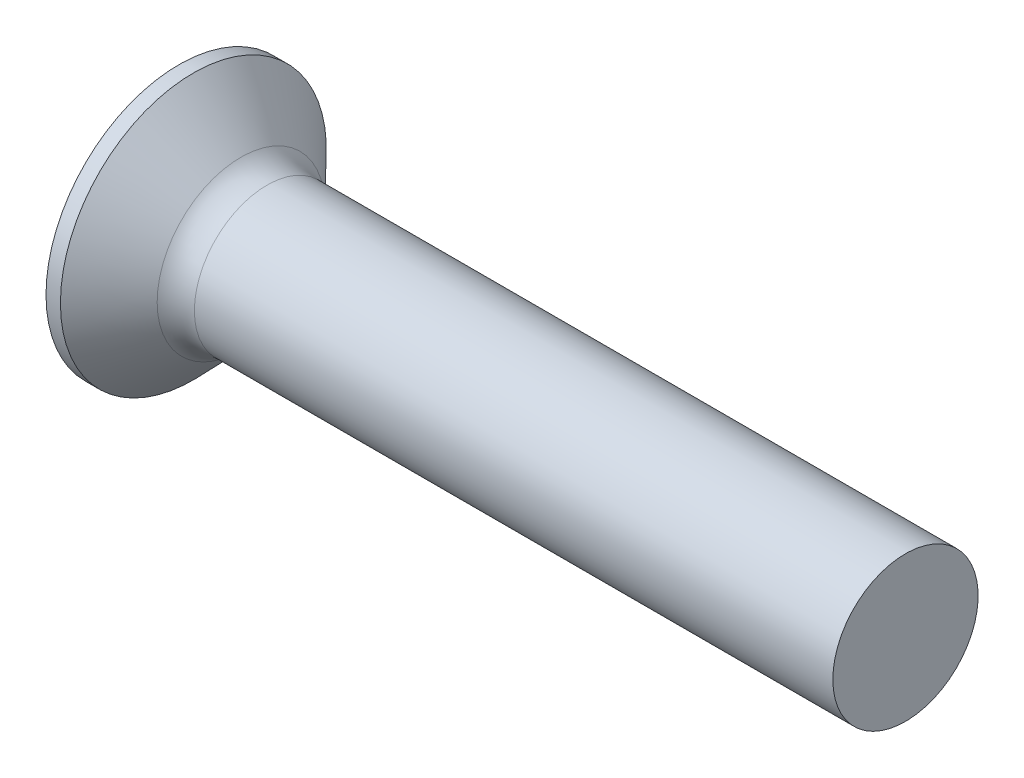
ISO-10303-21;
HEADER;
FILE_DESCRIPTION(('STEP AP214'),'2;1');
FILE_NAME('part.step','',(''),(''),'','','');
FILE_SCHEMA(('AUTOMOTIVE_DESIGN { 1 0 10303 214 1 1 1 1 }'));
ENDSEC;
DATA;
#1=APPLICATION_CONTEXT('core data for automotive mechanical design processes');
#2=APPLICATION_PROTOCOL_DEFINITION('international standard','automotive_design',2000,#1);
#3=PRODUCT_CONTEXT('',#1,'mechanical');
#4=PRODUCT('Part','Part','',(#3));
#5=PRODUCT_RELATED_PRODUCT_CATEGORY('part','',(#4));
#6=PRODUCT_DEFINITION_FORMATION('','',#4);
#7=PRODUCT_DEFINITION_CONTEXT('part definition',#1,'design');
#8=PRODUCT_DEFINITION('design','',#6,#7);
#9=PRODUCT_DEFINITION_SHAPE('','',#8);
#10=(LENGTH_UNIT() NAMED_UNIT(*) SI_UNIT(.MILLI.,.METRE.));
#11=(NAMED_UNIT(*) PLANE_ANGLE_UNIT() SI_UNIT($,.RADIAN.));
#12=(NAMED_UNIT(*) SI_UNIT($,.STERADIAN.) SOLID_ANGLE_UNIT());
#13=UNCERTAINTY_MEASURE_WITH_UNIT(LENGTH_MEASURE(1.E-05),#10,'distance_accuracy_value','');
#14=(GEOMETRIC_REPRESENTATION_CONTEXT(3) GLOBAL_UNCERTAINTY_ASSIGNED_CONTEXT((#13)) GLOBAL_UNIT_ASSIGNED_CONTEXT((#10,
#11,#12)) REPRESENTATION_CONTEXT('',''));
#15=CARTESIAN_POINT('',(0.,0.,0.));
#16=DIRECTION('',(0.,0.,1.));
#17=DIRECTION('',(1.,0.,0.));
#18=AXIS2_PLACEMENT_3D('',#15,#16,#17);
#19=CARTESIAN_POINT('',(5.64,-2.08800020083358,1.08));
#20=DIRECTION('',(0.,0.,-1.));
#21=DIRECTION('',(0.,1.,0.));
#22=AXIS2_PLACEMENT_3D('',#19,#20,#21);
#23=PLANE('',#22);
#24=DIRECTION('',(0.,-1.,0.));
#25=VECTOR('',#24,1.);
#26=CARTESIAN_POINT('',(0.,4.9,1.08));
#27=LINE('',#26,#25);
#28=CARTESIAN_POINT('',(0.,-2.05881047761803,1.08));
#29=VERTEX_POINT('',#28);
#30=CARTESIAN_POINT('',(0.,-4.9,1.08));
#31=VERTEX_POINT('',#30);
#32=EDGE_CURVE('E312',#29,#31,#27,.T.);
#33=ORIENTED_EDGE('',*,*,#32,.F.);
#34=CARTESIAN_POINT('',(-3.508552371452,-2.33231165002222,1.08));
#35=CARTESIAN_POINT('',(-2.8021242785535,-2.27786290347494,1.08));
#36=CARTESIAN_POINT('',(-2.09572000083794,-2.22310096882498,1.08));
#37=CARTESIAN_POINT('',(-0.682963739884883,-2.11273813340588,1.08));
#38=CARTESIAN_POINT('',(0.023388242128016,-2.05713721697088,1.08));
#39=CARTESIAN_POINT('',(1.08285390271521,-1.97294867301993,1.08));
#40=CARTESIAN_POINT('',(1.43599884659094,-1.94475462132179,1.08));
#41=CARTESIAN_POINT('',(2.14226366201043,-1.88806550876942,1.08));
#42=CARTESIAN_POINT('',(2.49538353361693,-1.8595704486972,1.08));
#43=CARTESIAN_POINT('',(3.2015889523463,-1.8022365024152,1.08));
#44=CARTESIAN_POINT('',(3.55467449997447,-1.77339762243347,1.08));
#45=CARTESIAN_POINT('',(4.26081605784269,-1.71532132056914,1.08));
#46=CARTESIAN_POINT('',(4.61387206778542,-1.68608389507013,1.08));
#47=CARTESIAN_POINT('',(5.41612732471709,-1.61911650604659,1.08));
#48=CARTESIAN_POINT('',(5.86531460668916,-1.58124295320442,1.08));
#49=CARTESIAN_POINT('',(6.76360881538388,-1.50456871786306,1.08));
#50=CARTESIAN_POINT('',(7.21271574234448,-1.46576803815681,1.08));
#51=CARTESIAN_POINT('',(8.11080846678724,-1.38699687421515,1.08));
#52=CARTESIAN_POINT('',(8.55979426851681,-1.34702643850978,1.08));
#53=CARTESIAN_POINT('',(9.45763439362018,-1.26556606443146,1.08));
#54=CARTESIAN_POINT('',(9.90648871523721,-1.22407610661242,1.08));
#55=CARTESIAN_POINT('',(10.804086472022,-1.13904091064148,1.08));
#56=CARTESIAN_POINT('',(11.2528298716191,-1.09549529593565,1.08));
#57=CARTESIAN_POINT('',(12.1500162616112,-1.00552937785306,1.08));
#58=CARTESIAN_POINT('',(12.5984592620319,-0.959109175798602,1.08));
#59=CARTESIAN_POINT('',(13.2708059653168,-0.8861578155995,1.08));
#60=CARTESIAN_POINT('',(13.4948891256712,-0.861284749868425,1.08));
#61=CARTESIAN_POINT('',(13.9428873803505,-0.810096676380915,1.08));
#62=CARTESIAN_POINT('',(14.1668024775431,-0.783781693824127,1.08));
#63=CARTESIAN_POINT('',(14.6144284155526,-0.729227223623335,1.08));
#64=CARTESIAN_POINT('',(14.8381392281789,-0.700987502036454,1.08));
#65=CARTESIAN_POINT('',(15.1734409779729,-0.656575769482208,1.08));
#66=CARTESIAN_POINT('',(15.2851674140663,-0.64142936052081,1.08));
#67=CARTESIAN_POINT('',(15.5085023247459,-0.610277030221323,1.08));
#68=CARTESIAN_POINT('',(15.6201107970542,-0.594271092583295,1.08));
#69=CARTESIAN_POINT('',(15.731644359719,-0.577747837441693,1.08));
#70=B_SPLINE_CURVE_WITH_KNOTS('',3,(#34,#35,#36,#37,#38,#39,#40,#41,#42,#43,#44,#45,#46,#47,#48,
#49,#50,#51,#52,#53,#54,#55,#56,#57,#58,#59,#60,#61,#62,#63,#64,#65,#66,#67,#68,#69),
.UNSPECIFIED.,.F.,.F.,(4,2,2,2,2,2,2,2,2,2,2,2,2,2,2,2,2,4),(0.,2.12557045381571,
4.25118064652266,5.31398639952898,6.37678939206669,7.4395731618212,8.50236658170693,
9.85470917308544,11.2070476910761,12.559330183477,13.9116299877686,15.2641784740572,
16.6166793133679,17.2930539423714,17.9694167544874,18.6458619223979,18.984104295463,
19.3223530851586),.UNSPECIFIED.);
#71=CARTESIAN_POINT('',(5.64,-1.60013444747621,1.08));
#72=VERTEX_POINT('',#71);
#73=EDGE_CURVE('E192',#29,#72,#70,.T.);
#74=ORIENTED_EDGE('',*,*,#73,.T.);
#75=DIRECTION('',(0.,-1.,0.));
#76=VECTOR('',#75,1.);
#77=CARTESIAN_POINT('',(5.64,2.08800020083358,1.08));
#78=LINE('',#77,#76);
#79=CARTESIAN_POINT('',(5.64,-2.08800020083358,1.08));
#80=VERTEX_POINT('',#79);
#81=EDGE_CURVE('E336',#72,#80,#78,.T.);
#82=ORIENTED_EDGE('',*,*,#81,.T.);
#83=DIRECTION('',(0.894934391398443,0.446197753347436,0.));
#84=VECTOR('',#83,1.);
#85=CARTESIAN_POINT('',(0.,-4.9,1.08));
#86=LINE('',#85,#84);
#87=EDGE_CURVE('E323',#31,#80,#86,.T.);
#88=ORIENTED_EDGE('',*,*,#87,.F.);
#89=EDGE_LOOP('',(#33,#74,#82,#88));
#90=FACE_BOUND('',#89,.T.);
#91=ADVANCED_FACE('F34',(#90),#23,.T.);
#92=CARTESIAN_POINT('',(5.64,2.08800020083359,1.08));
#93=VERTEX_POINT('',#92);
#94=CARTESIAN_POINT('',(5.64,1.60013444747621,1.08));
#95=VERTEX_POINT('',#94);
#96=EDGE_CURVE('E338',#93,#95,#78,.T.);
#97=ORIENTED_EDGE('',*,*,#96,.T.);
#98=CARTESIAN_POINT('',(-3.508552371452,2.33231165002222,1.08));
#99=CARTESIAN_POINT('',(-2.8021242785535,2.27786290347494,1.08));
#100=CARTESIAN_POINT('',(-2.09572000083793,2.22310096882498,1.08));
#101=CARTESIAN_POINT('',(-0.682963739884882,2.11273813340588,1.08));
#102=CARTESIAN_POINT('',(0.0233882421280164,2.05713721697088,1.08));
#103=CARTESIAN_POINT('',(1.08285390271521,1.97294867301993,1.08));
#104=CARTESIAN_POINT('',(1.43599884659094,1.94475462132179,1.08));
#105=CARTESIAN_POINT('',(2.14226366201043,1.88806550876942,1.08));
#106=CARTESIAN_POINT('',(2.49538353361693,1.8595704486972,1.08));
#107=CARTESIAN_POINT('',(3.2015889523463,1.8022365024152,1.08));
#108=CARTESIAN_POINT('',(3.55467449997447,1.77339762243347,1.08));
#109=CARTESIAN_POINT('',(4.26081605784269,1.71532132056914,1.08));
#110=CARTESIAN_POINT('',(4.61387206778542,1.68608389507013,1.08));
#111=CARTESIAN_POINT('',(5.41612732471709,1.61911650604659,1.08));
#112=CARTESIAN_POINT('',(5.86531460668916,1.58124295320442,1.08));
#113=CARTESIAN_POINT('',(6.76360881538388,1.50456871786306,1.08));
#114=CARTESIAN_POINT('',(7.21271574234448,1.46576803815681,1.08));
#115=CARTESIAN_POINT('',(8.11080846678724,1.38699687421515,1.08));
#116=CARTESIAN_POINT('',(8.55979426851681,1.34702643850978,1.08));
#117=CARTESIAN_POINT('',(9.45763439362018,1.26556606443146,1.08));
#118=CARTESIAN_POINT('',(9.90648871523721,1.22407610661242,1.08));
#119=CARTESIAN_POINT('',(10.804086472022,1.13904091064148,1.08));
#120=CARTESIAN_POINT('',(11.2528298716191,1.09549529593565,1.08));
#121=CARTESIAN_POINT('',(12.1500162616112,1.00552937785306,1.08));
#122=CARTESIAN_POINT('',(12.5984592620319,0.959109175798602,1.08));
#123=CARTESIAN_POINT('',(13.2708059653168,0.8861578155995,1.08));
#124=CARTESIAN_POINT('',(13.4948891256712,0.861284749868425,1.08));
#125=CARTESIAN_POINT('',(13.9428873803505,0.810096676380915,1.08));
#126=CARTESIAN_POINT('',(14.1668024775431,0.783781693824127,1.08));
#127=CARTESIAN_POINT('',(14.6144284155526,0.729227223623334,1.08));
#128=CARTESIAN_POINT('',(14.8381392281789,0.700987502036454,1.08));
#129=CARTESIAN_POINT('',(15.1734409779729,0.656575769482207,1.08));
#130=CARTESIAN_POINT('',(15.2851674140663,0.64142936052081,1.08));
#131=CARTESIAN_POINT('',(15.5085023247459,0.610277030221323,1.08));
#132=CARTESIAN_POINT('',(15.6201107970543,0.594271092583295,1.08));
#133=CARTESIAN_POINT('',(15.731644359719,0.577747837441693,1.08));
#134=B_SPLINE_CURVE_WITH_KNOTS('',3,(#98,#99,#100,#101,#102,#103,#104,#105,#106,#107,#108,#109,
#110,#111,#112,#113,#114,#115,#116,#117,#118,#119,#120,#121,#122,#123,#124,#125,#126,#127,#128,
#129,#130,#131,#132,#133),.UNSPECIFIED.,.F.,.F.,(4,2,2,2,2,2,2,2,2,2,2,2,2,2,2,2,2,4),(0.,
2.12557045381571,4.25118064652265,5.31398639952898,6.37678939206668,7.43957316182119,
8.50236658170693,9.85470917308544,11.2070476910761,12.559330183477,13.9116299877686,
15.2641784740572,16.6166793133679,17.2930539423714,17.9694167544874,18.6458619223979,
18.984104295463,19.3223530851586),.UNSPECIFIED.);
#135=CARTESIAN_POINT('',(0.,2.05881047761803,1.08));
#136=VERTEX_POINT('',#135);
#137=EDGE_CURVE('E185',#95,#136,#134,.F.);
#138=ORIENTED_EDGE('',*,*,#137,.T.);
#139=CARTESIAN_POINT('',(0.,4.9,1.08));
#140=VERTEX_POINT('',#139);
#141=EDGE_CURVE('E314',#140,#136,#27,.T.);
#142=ORIENTED_EDGE('',*,*,#141,.F.);
#143=DIRECTION('',(0.894934391398442,-0.446197753347436,0.));
#144=VECTOR('',#143,1.);
#145=CARTESIAN_POINT('',(0.,4.9,1.08));
#146=LINE('',#145,#144);
#147=EDGE_CURVE('E63',#140,#93,#146,.T.);
#148=ORIENTED_EDGE('',*,*,#147,.T.);
#149=EDGE_LOOP('',(#97,#138,#142,#148));
#150=FACE_BOUND('',#149,.T.);
#151=ADVANCED_FACE('F167',(#150),#23,.T.);
#152=CARTESIAN_POINT('',(5.64,2.08800020083359,-1.08));
#153=DIRECTION('',(0.,0.,1.));
#154=DIRECTION('',(0.,-1.,0.));
#155=AXIS2_PLACEMENT_3D('',#152,#153,#154);
#156=PLANE('',#155);
#157=DIRECTION('',(0.,1.,0.));
#158=VECTOR('',#157,1.);
#159=CARTESIAN_POINT('',(5.64,-2.08800020083359,-1.08));
#160=LINE('',#159,#158);
#161=CARTESIAN_POINT('',(5.64,-2.08800020083359,-1.08));
#162=VERTEX_POINT('',#161);
#163=CARTESIAN_POINT('',(5.64,-1.60013444747621,-1.08));
#164=VERTEX_POINT('',#163);
#165=EDGE_CURVE('E337',#162,#164,#160,.T.);
#166=ORIENTED_EDGE('',*,*,#165,.T.);
#167=CARTESIAN_POINT('',(-3.508552371452,-2.33231165002222,-1.08));
#168=CARTESIAN_POINT('',(-2.8021242785535,-2.27786290347494,-1.08));
#169=CARTESIAN_POINT('',(-2.09572000083793,-2.22310096882498,-1.08));
#170=CARTESIAN_POINT('',(-0.682963739884882,-2.11273813340588,-1.08));
#171=CARTESIAN_POINT('',(0.0233882421280164,-2.05713721697088,-1.08));
#172=CARTESIAN_POINT('',(1.08285390271521,-1.97294867301993,-1.08));
#173=CARTESIAN_POINT('',(1.43599884659094,-1.94475462132179,-1.08));
#174=CARTESIAN_POINT('',(2.14226366201043,-1.88806550876942,-1.08));
#175=CARTESIAN_POINT('',(2.49538353361693,-1.8595704486972,-1.08));
#176=CARTESIAN_POINT('',(3.2015889523463,-1.8022365024152,-1.08));
#177=CARTESIAN_POINT('',(3.55467449997447,-1.77339762243347,-1.08));
#178=CARTESIAN_POINT('',(4.26081605784269,-1.71532132056914,-1.08));
#179=CARTESIAN_POINT('',(4.61387206778542,-1.68608389507013,-1.08));
#180=CARTESIAN_POINT('',(5.41612732471709,-1.61911650604659,-1.08));
#181=CARTESIAN_POINT('',(5.86531460668916,-1.58124295320442,-1.08));
#182=CARTESIAN_POINT('',(6.76360881538388,-1.50456871786306,-1.08));
#183=CARTESIAN_POINT('',(7.21271574234448,-1.46576803815681,-1.08));
#184=CARTESIAN_POINT('',(8.11080846678724,-1.38699687421515,-1.08));
#185=CARTESIAN_POINT('',(8.55979426851681,-1.34702643850978,-1.08));
#186=CARTESIAN_POINT('',(9.45763439362018,-1.26556606443146,-1.08));
#187=CARTESIAN_POINT('',(9.90648871523721,-1.22407610661242,-1.08));
#188=CARTESIAN_POINT('',(10.804086472022,-1.13904091064148,-1.08));
#189=CARTESIAN_POINT('',(11.2528298716191,-1.09549529593565,-1.08));
#190=CARTESIAN_POINT('',(12.1500162616112,-1.00552937785306,-1.08));
#191=CARTESIAN_POINT('',(12.5984592620319,-0.959109175798602,-1.08));
#192=CARTESIAN_POINT('',(13.2708059653168,-0.8861578155995,-1.08));
#193=CARTESIAN_POINT('',(13.4948891256712,-0.861284749868425,-1.08));
#194=CARTESIAN_POINT('',(13.9428873803505,-0.810096676380915,-1.08));
#195=CARTESIAN_POINT('',(14.1668024775431,-0.783781693824127,-1.08));
#196=CARTESIAN_POINT('',(14.6144284155526,-0.729227223623334,-1.08));
#197=CARTESIAN_POINT('',(14.8381392281789,-0.700987502036453,-1.08));
#198=CARTESIAN_POINT('',(15.1734409779729,-0.656575769482206,-1.08));
#199=CARTESIAN_POINT('',(15.2851674140663,-0.641429360520809,-1.08));
#200=CARTESIAN_POINT('',(15.5085023247459,-0.610277030221322,-1.08));
#201=CARTESIAN_POINT('',(15.6201107970543,-0.594271092583294,-1.08));
#202=CARTESIAN_POINT('',(15.731644359719,-0.577747837441693,-1.08));
#203=B_SPLINE_CURVE_WITH_KNOTS('',3,(#167,#168,#169,#170,#171,#172,#173,#174,#175,#176,#177,
#178,#179,#180,#181,#182,#183,#184,#185,#186,#187,#188,#189,#190,#191,#192,#193,#194,#195,#196,
#197,#198,#199,#200,#201,#202),.UNSPECIFIED.,.F.,.F.,(4,2,2,2,2,2,2,2,2,2,2,2,2,2,2,2,2,4),(0.,
2.12557045381571,4.25118064652265,5.31398639952898,6.37678939206668,7.43957316182119,
8.50236658170693,9.85470917308544,11.2070476910761,12.559330183477,13.9116299877686,
15.2641784740572,16.6166793133679,17.2930539423714,17.9694167544874,18.6458619223979,
18.984104295463,19.3223530851586),.UNSPECIFIED.);
#204=CARTESIAN_POINT('',(0.,-2.05881047761803,-1.08));
#205=VERTEX_POINT('',#204);
#206=EDGE_CURVE('E238',#164,#205,#203,.F.);
#207=ORIENTED_EDGE('',*,*,#206,.T.);
#208=DIRECTION('',(0.,1.,0.));
#209=VECTOR('',#208,1.);
#210=CARTESIAN_POINT('',(0.,-4.9,-1.08));
#211=LINE('',#210,#209);
#212=CARTESIAN_POINT('',(0.,-4.9,-1.08));
#213=VERTEX_POINT('',#212);
#214=EDGE_CURVE('E313',#213,#205,#211,.T.);
#215=ORIENTED_EDGE('',*,*,#214,.F.);
#216=DIRECTION('',(0.894934391398443,0.446197753347436,0.));
#217=VECTOR('',#216,1.);
#218=CARTESIAN_POINT('',(0.,-4.9,-1.08));
#219=LINE('',#218,#217);
#220=EDGE_CURVE('E326',#213,#162,#219,.T.);
#221=ORIENTED_EDGE('',*,*,#220,.T.);
#222=EDGE_LOOP('',(#166,#207,#215,#221));
#223=FACE_BOUND('',#222,.T.);
#224=ADVANCED_FACE('F173',(#223),#156,.T.);
#225=CARTESIAN_POINT('',(0.,2.05881047761803,-1.08));
#226=VERTEX_POINT('',#225);
#227=CARTESIAN_POINT('',(0.,4.9,-1.08));
#228=VERTEX_POINT('',#227);
#229=EDGE_CURVE('E322',#226,#228,#211,.T.);
#230=ORIENTED_EDGE('',*,*,#229,.F.);
#231=CARTESIAN_POINT('',(-3.508552371452,2.33231165002222,-1.08));
#232=CARTESIAN_POINT('',(-2.8021242785535,2.27786290347494,-1.08));
#233=CARTESIAN_POINT('',(-2.09572000083794,2.22310096882498,-1.08));
#234=CARTESIAN_POINT('',(-0.682963739884883,2.11273813340588,-1.08));
#235=CARTESIAN_POINT('',(0.023388242128016,2.05713721697088,-1.08));
#236=CARTESIAN_POINT('',(1.08285390271521,1.97294867301993,-1.08));
#237=CARTESIAN_POINT('',(1.43599884659094,1.94475462132179,-1.08));
#238=CARTESIAN_POINT('',(2.14226366201043,1.88806550876942,-1.08));
#239=CARTESIAN_POINT('',(2.49538353361693,1.8595704486972,-1.08));
#240=CARTESIAN_POINT('',(3.2015889523463,1.8022365024152,-1.08));
#241=CARTESIAN_POINT('',(3.55467449997447,1.77339762243347,-1.08));
#242=CARTESIAN_POINT('',(4.26081605784269,1.71532132056914,-1.08));
#243=CARTESIAN_POINT('',(4.61387206778542,1.68608389507013,-1.08));
#244=CARTESIAN_POINT('',(5.41612732471709,1.61911650604659,-1.08));
#245=CARTESIAN_POINT('',(5.86531460668916,1.58124295320442,-1.08));
#246=CARTESIAN_POINT('',(6.76360881538388,1.50456871786306,-1.08));
#247=CARTESIAN_POINT('',(7.21271574234448,1.46576803815681,-1.08));
#248=CARTESIAN_POINT('',(8.11080846678724,1.38699687421515,-1.08));
#249=CARTESIAN_POINT('',(8.55979426851681,1.34702643850978,-1.08));
#250=CARTESIAN_POINT('',(9.45763439362018,1.26556606443146,-1.08));
#251=CARTESIAN_POINT('',(9.90648871523721,1.22407610661242,-1.08));
#252=CARTESIAN_POINT('',(10.804086472022,1.13904091064148,-1.08));
#253=CARTESIAN_POINT('',(11.2528298716191,1.09549529593565,-1.08));
#254=CARTESIAN_POINT('',(12.1500162616112,1.00552937785306,-1.08));
#255=CARTESIAN_POINT('',(12.5984592620319,0.959109175798602,-1.08));
#256=CARTESIAN_POINT('',(13.2708059653168,0.8861578155995,-1.08));
#257=CARTESIAN_POINT('',(13.4948891256712,0.861284749868425,-1.08));
#258=CARTESIAN_POINT('',(13.9428873803505,0.810096676380915,-1.08));
#259=CARTESIAN_POINT('',(14.1668024775431,0.783781693824127,-1.08));
#260=CARTESIAN_POINT('',(14.6144284155526,0.729227223623335,-1.08));
#261=CARTESIAN_POINT('',(14.8381392281789,0.700987502036455,-1.08));
#262=CARTESIAN_POINT('',(15.1734409779729,0.656575769482208,-1.08));
#263=CARTESIAN_POINT('',(15.2851674140663,0.641429360520811,-1.08));
#264=CARTESIAN_POINT('',(15.5085023247459,0.610277030221324,-1.08));
#265=CARTESIAN_POINT('',(15.6201107970542,0.594271092583296,-1.08));
#266=CARTESIAN_POINT('',(15.731644359719,0.577747837441694,-1.08));
#267=B_SPLINE_CURVE_WITH_KNOTS('',3,(#231,#232,#233,#234,#235,#236,#237,#238,#239,#240,#241,
#242,#243,#244,#245,#246,#247,#248,#249,#250,#251,#252,#253,#254,#255,#256,#257,#258,#259,#260,
#261,#262,#263,#264,#265,#266),.UNSPECIFIED.,.F.,.F.,(4,2,2,2,2,2,2,2,2,2,2,2,2,2,2,2,2,4),(0.,
2.12557045381571,4.25118064652266,5.31398639952898,6.37678939206669,7.4395731618212,
8.50236658170693,9.85470917308544,11.2070476910761,12.559330183477,13.9116299877686,
15.2641784740572,16.6166793133679,17.2930539423714,17.9694167544874,18.6458619223979,
18.984104295463,19.3223530851586),.UNSPECIFIED.);
#268=CARTESIAN_POINT('',(5.64,1.60013444747621,-1.08));
#269=VERTEX_POINT('',#268);
#270=EDGE_CURVE('E233',#226,#269,#267,.T.);
#271=ORIENTED_EDGE('',*,*,#270,.T.);
#272=CARTESIAN_POINT('',(5.64,2.08800020083358,-1.08));
#273=VERTEX_POINT('',#272);
#274=EDGE_CURVE('E343',#269,#273,#160,.T.);
#275=ORIENTED_EDGE('',*,*,#274,.T.);
#276=DIRECTION('',(0.894934391398443,-0.446197753347436,0.));
#277=VECTOR('',#276,1.);
#278=CARTESIAN_POINT('',(0.,4.9,-1.08));
#279=LINE('',#278,#277);
#280=EDGE_CURVE('E330',#228,#273,#279,.T.);
#281=ORIENTED_EDGE('',*,*,#280,.F.);
#282=EDGE_LOOP('',(#230,#271,#275,#281));
#283=FACE_BOUND('',#282,.T.);
#284=ADVANCED_FACE('F459',(#283),#156,.T.);
#285=CARTESIAN_POINT('',(5.64,2.08800020083358,-1.08));
#286=DIRECTION('',(1.,0.,0.));
#287=DIRECTION('',(0.,0.,-1.));
#288=AXIS2_PLACEMENT_3D('',#285,#286,#287);
#289=PLANE('',#288);
#290=CARTESIAN_POINT('',(5.64,0.,0.));
#291=DIRECTION('',(-1.,0.,0.));
#292=DIRECTION('',(0.,0.,1.));
#293=AXIS2_PLACEMENT_3D('',#290,#291,#292);
#294=CIRCLE('',#293,1.9305);
#295=EDGE_CURVE('E282',#164,#72,#294,.T.);
#296=ORIENTED_EDGE('',*,*,#295,.F.);
#297=ORIENTED_EDGE('',*,*,#165,.F.);
#298=DIRECTION('',(0.,0.,-1.));
#299=VECTOR('',#298,1.);
#300=CARTESIAN_POINT('',(5.64,-2.08800020083358,1.08));
#301=LINE('',#300,#299);
#302=EDGE_CURVE('E333',#80,#162,#301,.T.);
#303=ORIENTED_EDGE('',*,*,#302,.F.);
#304=ORIENTED_EDGE('',*,*,#81,.F.);
#305=EDGE_LOOP('',(#296,#297,#303,#304));
#306=FACE_BOUND('',#305,.T.);
#307=ADVANCED_FACE('F416',(#306),#289,.F.);
#308=CARTESIAN_POINT('',(5.64,-1.08000000000001,1.60013444747621));
#309=VERTEX_POINT('',#308);
#310=CARTESIAN_POINT('',(5.64,1.07999999999999,1.60013444747622));
#311=VERTEX_POINT('',#310);
#312=EDGE_CURVE('E275',#309,#311,#294,.T.);
#313=ORIENTED_EDGE('',*,*,#312,.F.);
#314=DIRECTION('',(0.,0.,-1.));
#315=VECTOR('',#314,1.);
#316=CARTESIAN_POINT('',(5.64,-1.08000000000001,2.08800020083358));
#317=LINE('',#316,#315);
#318=CARTESIAN_POINT('',(5.64,-1.08000000000001,2.08800020083358));
#319=VERTEX_POINT('',#318);
#320=EDGE_CURVE('E401',#319,#309,#317,.T.);
#321=ORIENTED_EDGE('',*,*,#320,.F.);
#322=DIRECTION('',(0.,-1.,0.));
#323=VECTOR('',#322,1.);
#324=CARTESIAN_POINT('',(5.64,1.07999999999999,2.08800020083359));
#325=LINE('',#324,#323);
#326=CARTESIAN_POINT('',(5.64,1.07999999999999,2.08800020083359));
#327=VERTEX_POINT('',#326);
#328=EDGE_CURVE('E301',#327,#319,#325,.T.);
#329=ORIENTED_EDGE('',*,*,#328,.F.);
#330=DIRECTION('',(0.,0.,1.));
#331=VECTOR('',#330,1.);
#332=CARTESIAN_POINT('',(5.64,1.08000000000001,-2.08800020083358));
#333=LINE('',#332,#331);
#334=EDGE_CURVE('E199',#311,#327,#333,.T.);
#335=ORIENTED_EDGE('',*,*,#334,.F.);
#336=EDGE_LOOP('',(#313,#321,#329,#335));
#337=FACE_BOUND('',#336,.T.);
#338=ADVANCED_FACE('F451',(#337),#289,.F.);
#339=EDGE_CURVE('E274',#95,#269,#294,.T.);
#340=ORIENTED_EDGE('',*,*,#339,.F.);
#341=ORIENTED_EDGE('',*,*,#96,.F.);
#342=DIRECTION('',(0.,0.,1.));
#343=VECTOR('',#342,1.);
#344=CARTESIAN_POINT('',(5.64,2.08800020083358,-1.08));
#345=LINE('',#344,#343);
#346=EDGE_CURVE('E334',#273,#93,#345,.T.);
#347=ORIENTED_EDGE('',*,*,#346,.F.);
#348=ORIENTED_EDGE('',*,*,#274,.F.);
#349=EDGE_LOOP('',(#340,#341,#347,#348));
#350=FACE_BOUND('',#349,.T.);
#351=ADVANCED_FACE('F431',(#350),#289,.F.);
#352=CARTESIAN_POINT('',(5.64,1.07999999999999,2.08800020083359));
#353=DIRECTION('',(0.,-1.,0.));
#354=DIRECTION('',(0.,0.,-1.));
#355=AXIS2_PLACEMENT_3D('',#352,#353,#354);
#356=PLANE('',#355);
#357=CARTESIAN_POINT('',(5.64,1.08000000000001,-2.08800020083358));
#358=VERTEX_POINT('',#357);
#359=CARTESIAN_POINT('',(5.64,1.08000000000001,-1.60013444747621));
#360=VERTEX_POINT('',#359);
#361=EDGE_CURVE('E296',#358,#360,#333,.T.);
#362=ORIENTED_EDGE('',*,*,#361,.T.);
#363=CARTESIAN_POINT('',(-3.508552371452,1.08000000000001,-2.33231165002222));
#364=CARTESIAN_POINT('',(-2.8021242785535,1.08000000000001,-2.27786290347493));
#365=CARTESIAN_POINT('',(-2.09572000083793,1.08000000000001,-2.22310096882497));
#366=CARTESIAN_POINT('',(-0.682963739884882,1.08000000000001,-2.11273813340588));
#367=CARTESIAN_POINT('',(0.0233882421280166,1.08000000000001,-2.05713721697088));
#368=CARTESIAN_POINT('',(1.08285390271521,1.08000000000001,-1.97294867301992));
#369=CARTESIAN_POINT('',(1.43599884659094,1.08000000000001,-1.94475462132178));
#370=CARTESIAN_POINT('',(2.14226366201043,1.08000000000001,-1.88806550876941));
#371=CARTESIAN_POINT('',(2.49538353361693,1.08000000000001,-1.8595704486972));
#372=CARTESIAN_POINT('',(3.2015889523463,1.08000000000001,-1.8022365024152));
#373=CARTESIAN_POINT('',(3.55467449997447,1.08000000000001,-1.77339762243347));
#374=CARTESIAN_POINT('',(4.26081605784269,1.08000000000001,-1.71532132056914));
#375=CARTESIAN_POINT('',(4.61387206778542,1.08000000000001,-1.68608389507012));
#376=CARTESIAN_POINT('',(5.41612732471709,1.08000000000001,-1.61911650604659));
#377=CARTESIAN_POINT('',(5.86531460668917,1.08000000000001,-1.58124295320442));
#378=CARTESIAN_POINT('',(6.76360881538388,1.08000000000001,-1.50456871786305));
#379=CARTESIAN_POINT('',(7.21271574234448,1.08000000000001,-1.46576803815681));
#380=CARTESIAN_POINT('',(8.11080846678724,1.08,-1.38699687421514));
#381=CARTESIAN_POINT('',(8.55979426851682,1.08,-1.34702643850977));
#382=CARTESIAN_POINT('',(9.45763439362019,1.08,-1.26556606443145));
#383=CARTESIAN_POINT('',(9.90648871523721,1.08,-1.22407610661242));
#384=CARTESIAN_POINT('',(10.804086472022,1.08,-1.13904091064148));
#385=CARTESIAN_POINT('',(11.2528298716191,1.08,-1.09549529593564));
#386=CARTESIAN_POINT('',(12.1500162616112,1.08,-1.00552937785305));
#387=CARTESIAN_POINT('',(12.5984592620319,1.08,-0.959109175798598));
#388=CARTESIAN_POINT('',(13.2708059653168,1.08,-0.886157815599496));
#389=CARTESIAN_POINT('',(13.4948891256712,1.08,-0.861284749868421));
#390=CARTESIAN_POINT('',(13.9428873803505,1.08,-0.810096676380911));
#391=CARTESIAN_POINT('',(14.1668024775431,1.08,-0.783781693824123));
#392=CARTESIAN_POINT('',(14.6144284155526,1.08,-0.729227223623331));
#393=CARTESIAN_POINT('',(14.8381392281789,1.08,-0.70098750203645));
#394=CARTESIAN_POINT('',(15.1734409779729,1.08,-0.656575769482203));
#395=CARTESIAN_POINT('',(15.2851674140663,1.08,-0.641429360520806));
#396=CARTESIAN_POINT('',(15.5085023247459,1.08,-0.610277030221319));
#397=CARTESIAN_POINT('',(15.6201107970542,1.08,-0.594271092583291));
#398=CARTESIAN_POINT('',(15.731644359719,1.08,-0.577747837441689));
#399=B_SPLINE_CURVE_WITH_KNOTS('',3,(#363,#364,#365,#366,#367,#368,#369,#370,#371,#372,#373,
#374,#375,#376,#377,#378,#379,#380,#381,#382,#383,#384,#385,#386,#387,#388,#389,#390,#391,#392,
#393,#394,#395,#396,#397,#398),.UNSPECIFIED.,.F.,.F.,(4,2,2,2,2,2,2,2,2,2,2,2,2,2,2,2,2,4),(0.,
2.12557045381571,4.25118064652265,5.31398639952898,6.37678939206668,7.43957316182119,
8.50236658170693,9.85470917308545,11.2070476910761,12.559330183477,13.9116299877686,
15.2641784740572,16.6166793133679,17.2930539423714,17.9694167544874,18.6458619223979,
18.984104295463,19.3223530851586),.UNSPECIFIED.);
#400=CARTESIAN_POINT('',(0.,1.08000000000001,-2.05881047761803));
#401=VERTEX_POINT('',#400);
#402=EDGE_CURVE('E226',#360,#401,#399,.F.);
#403=ORIENTED_EDGE('',*,*,#402,.T.);
#404=DIRECTION('',(0.,0.,1.));
#405=VECTOR('',#404,1.);
#406=CARTESIAN_POINT('',(0.,1.08000000000002,-4.9));
#407=LINE('',#406,#405);
#408=CARTESIAN_POINT('',(0.,1.08000000000002,-4.9));
#409=VERTEX_POINT('',#408);
#410=EDGE_CURVE('E390',#409,#401,#407,.T.);
#411=ORIENTED_EDGE('',*,*,#410,.F.);
#412=DIRECTION('',(0.894934391398443,0.,0.446197753347436));
#413=VECTOR('',#412,1.);
#414=CARTESIAN_POINT('',(0.,1.08000000000002,-4.9));
#415=LINE('',#414,#413);
#416=EDGE_CURVE('E300',#409,#358,#415,.T.);
#417=ORIENTED_EDGE('',*,*,#416,.T.);
#418=EDGE_LOOP('',(#362,#403,#411,#417));
#419=FACE_BOUND('',#418,.T.);
#420=ADVANCED_FACE('F299',(#419),#356,.T.);
#421=CARTESIAN_POINT('',(5.64,-1.07999999999999,-2.08800020083359));
#422=DIRECTION('',(0.,1.,0.));
#423=DIRECTION('',(0.,0.,1.));
#424=AXIS2_PLACEMENT_3D('',#421,#422,#423);
#425=PLANE('',#424);
#426=DIRECTION('',(0.,0.,-1.));
#427=VECTOR('',#426,1.);
#428=CARTESIAN_POINT('',(0.,-1.08000000000002,4.9));
#429=LINE('',#428,#427);
#430=CARTESIAN_POINT('',(0.,-1.07999999999999,-2.05881047761803));
#431=VERTEX_POINT('',#430);
#432=CARTESIAN_POINT('',(0.,-1.07999999999998,-4.9));
#433=VERTEX_POINT('',#432);
#434=EDGE_CURVE('E386',#431,#433,#429,.T.);
#435=ORIENTED_EDGE('',*,*,#434,.F.);
#436=CARTESIAN_POINT('',(-3.50855235785895,-1.07999999999999,-2.33231164897475));
#437=CARTESIAN_POINT('',(-2.80212426669874,-1.07999999999999,-2.27786290255719));
#438=CARTESIAN_POINT('',(-2.09571999072138,-1.07999999999999,-2.22310096803798));
#439=CARTESIAN_POINT('',(-0.682963733244686,-1.07999999999999,-2.11273813288379));
#440=CARTESIAN_POINT('',(0.0233882470300694,-1.07999999999999,-2.05713721658294));
#441=CARTESIAN_POINT('',(1.0828539044558,-1.07999999999999,-1.97294867288083));
#442=CARTESIAN_POINT('',(1.43599884690811,-1.07999999999999,-1.94475462129602));
#443=CARTESIAN_POINT('',(2.14226365948097,-1.07999999999999,-1.88806550897277));
#444=CARTESIAN_POINT('',(2.49538352966426,-1.07999999999999,-1.85957044901634));
#445=CARTESIAN_POINT('',(3.20158894554756,-1.07999999999999,-1.80223650296893));
#446=CARTESIAN_POINT('',(3.55467449175288,-1.07999999999999,-1.773397623106));
#447=CARTESIAN_POINT('',(4.26081604677565,-1.07999999999999,-1.715321321483));
#448=CARTESIAN_POINT('',(4.61387205529579,-1.07999999999999,-1.68608389610653));
#449=CARTESIAN_POINT('',(5.41612731080518,-1.07999999999999,-1.61911650721573));
#450=CARTESIAN_POINT('',(5.86531459277744,-1.07999999999999,-1.58124295438217));
#451=CARTESIAN_POINT('',(6.76360880147275,-1.07999999999999,-1.50456871906016));
#452=CARTESIAN_POINT('',(7.21271572843376,-1.08,-1.46576803936464));
#453=CARTESIAN_POINT('',(8.11080845287784,-1.08,-1.38699687544742));
#454=CARTESIAN_POINT('',(8.55979425460832,-1.08,-1.34702643975574));
#455=CARTESIAN_POINT('',(9.45763437971387,-1.08,-1.26556606570916));
#456=CARTESIAN_POINT('',(9.90648870133217,-1.08,-1.22407610790817));
#457=CARTESIAN_POINT('',(10.8040864581195,-1.08,-1.13904091198014));
#458=CARTESIAN_POINT('',(11.2528298577178,-1.08,-1.09549529729918));
#459=CARTESIAN_POINT('',(12.1500162477138,-1.08,-1.00552937927742));
#460=CARTESIAN_POINT('',(12.5984592481373,-1.08,-0.959109177258921));
#461=CARTESIAN_POINT('',(13.2708059514278,-1.08,-0.886157817129854));
#462=CARTESIAN_POINT('',(13.4948891117843,-1.08,-0.861284751424839));
#463=CARTESIAN_POINT('',(13.9428873664685,-1.08,-0.810096677997516));
#464=CARTESIAN_POINT('',(14.1668024636642,-1.08,-0.783781695474855));
#465=CARTESIAN_POINT('',(14.6144284016815,-1.08,-0.729227225354877));
#466=CARTESIAN_POINT('',(14.8381392143124,-1.08,-0.700987503814688));
#467=CARTESIAN_POINT('',(15.1734409641157,-1.08,-0.656575771346784));
#468=CARTESIAN_POINT('',(15.2851674002126,-1.08,-0.641429362416894));
#469=CARTESIAN_POINT('',(15.5085023109006,-1.08,-0.610277032188302));
#470=CARTESIAN_POINT('',(15.6201107832138,-1.08,-0.594271094589663));
#471=CARTESIAN_POINT('',(15.7316443458843,-1.08,-0.577747839492609));
#472=B_SPLINE_CURVE_WITH_KNOTS('',3,(#436,#437,#438,#439,#440,#441,#442,#443,#444,#445,#446,
#447,#448,#449,#450,#451,#452,#453,#454,#455,#456,#457,#458,#459,#460,#461,#462,#463,#464,#465,
#466,#467,#468,#469,#470,#471),.UNSPECIFIED.,.F.,.F.,(4,2,2,2,2,2,2,2,2,2,2,2,2,2,2,2,2,4),(0.,
2.12557044858637,4.25118063606338,5.31398638478592,6.3767893730399,7.439573138511,
8.50236655411318,9.85470914549009,11.2070476634792,12.5593301558792,13.9116299601696,
15.2641784464547,16.6166792857626,17.2930539147632,17.9694167268767,18.6458618947834,
18.9841042678463,19.3223530575396),.UNSPECIFIED.);
#473=CARTESIAN_POINT('',(5.64,-1.07999999999999,-1.60013444747621));
#474=VERTEX_POINT('',#473);
#475=EDGE_CURVE('E219',#431,#474,#472,.T.);
#476=ORIENTED_EDGE('',*,*,#475,.T.);
#477=CARTESIAN_POINT('',(5.64,-1.07999999999999,-2.08800020083359));
#478=VERTEX_POINT('',#477);
#479=EDGE_CURVE('E298',#474,#478,#317,.T.);
#480=ORIENTED_EDGE('',*,*,#479,.T.);
#481=DIRECTION('',(0.894934391398443,0.,0.446197753347436));
#482=VECTOR('',#481,1.);
#483=CARTESIAN_POINT('',(0.,-1.07999999999998,-4.9));
#484=LINE('',#483,#482);
#485=EDGE_CURVE('E393',#433,#478,#484,.T.);
#486=ORIENTED_EDGE('',*,*,#485,.F.);
#487=EDGE_LOOP('',(#435,#476,#480,#486));
#488=FACE_BOUND('',#487,.T.);
#489=ADVANCED_FACE('F404',(#488),#425,.T.);
#490=ORIENTED_EDGE('',*,*,#320,.T.);
#491=CARTESIAN_POINT('',(-3.508552371452,-1.08000000000001,2.33231165002222));
#492=CARTESIAN_POINT('',(-2.8021242785535,-1.08000000000001,2.27786290347493));
#493=CARTESIAN_POINT('',(-2.09572000083794,-1.08000000000001,2.22310096882497));
#494=CARTESIAN_POINT('',(-0.682963739884883,-1.08000000000001,2.11273813340588));
#495=CARTESIAN_POINT('',(0.023388242128016,-1.08000000000001,2.05713721697088));
#496=CARTESIAN_POINT('',(1.08285390271521,-1.08000000000001,1.97294867301992));
#497=CARTESIAN_POINT('',(1.43599884659094,-1.08000000000001,1.94475462132178));
#498=CARTESIAN_POINT('',(2.14226366201044,-1.08000000000001,1.88806550876941));
#499=CARTESIAN_POINT('',(2.49538353361694,-1.08000000000001,1.8595704486972));
#500=CARTESIAN_POINT('',(3.2015889523463,-1.08000000000001,1.8022365024152));
#501=CARTESIAN_POINT('',(3.55467449997447,-1.08000000000001,1.77339762243347));
#502=CARTESIAN_POINT('',(4.26081605784269,-1.08000000000001,1.71532132056914));
#503=CARTESIAN_POINT('',(4.61387206778542,-1.08000000000001,1.68608389507012));
#504=CARTESIAN_POINT('',(5.41612732471709,-1.08000000000001,1.61911650604659));
#505=CARTESIAN_POINT('',(5.86531460668917,-1.08000000000001,1.58124295320442));
#506=CARTESIAN_POINT('',(6.76360881538388,-1.08000000000001,1.50456871786305));
#507=CARTESIAN_POINT('',(7.21271574234448,-1.08000000000001,1.46576803815681));
#508=CARTESIAN_POINT('',(8.11080846678724,-1.08,1.38699687421514));
#509=CARTESIAN_POINT('',(8.55979426851682,-1.08,1.34702643850977));
#510=CARTESIAN_POINT('',(9.45763439362018,-1.08,1.26556606443145));
#511=CARTESIAN_POINT('',(9.90648871523721,-1.08,1.22407610661242));
#512=CARTESIAN_POINT('',(10.804086472022,-1.08,1.13904091064148));
#513=CARTESIAN_POINT('',(11.2528298716191,-1.08,1.09549529593564));
#514=CARTESIAN_POINT('',(12.1500162616112,-1.08,1.00552937785305));
#515=CARTESIAN_POINT('',(12.5984592620319,-1.08,0.959109175798599));
#516=CARTESIAN_POINT('',(13.2708059653168,-1.08,0.886157815599496));
#517=CARTESIAN_POINT('',(13.4948891256712,-1.08,0.861284749868421));
#518=CARTESIAN_POINT('',(13.9428873803505,-1.08,0.810096676380912));
#519=CARTESIAN_POINT('',(14.1668024775431,-1.08,0.783781693824123));
#520=CARTESIAN_POINT('',(14.6144284155526,-1.08,0.729227223623332));
#521=CARTESIAN_POINT('',(14.8381392281789,-1.08,0.700987502036451));
#522=CARTESIAN_POINT('',(15.1734409779729,-1.08,0.656575769482204));
#523=CARTESIAN_POINT('',(15.2851674140663,-1.08,0.641429360520807));
#524=CARTESIAN_POINT('',(15.5085023247459,-1.08,0.61027703022132));
#525=CARTESIAN_POINT('',(15.6201107970542,-1.08,0.594271092583292));
#526=CARTESIAN_POINT('',(15.731644359719,-1.08,0.57774783744169));
#527=B_SPLINE_CURVE_WITH_KNOTS('',3,(#491,#492,#493,#494,#495,#496,#497,#498,#499,#500,#501,
#502,#503,#504,#505,#506,#507,#508,#509,#510,#511,#512,#513,#514,#515,#516,#517,#518,#519,#520,
#521,#522,#523,#524,#525,#526),.UNSPECIFIED.,.F.,.F.,(4,2,2,2,2,2,2,2,2,2,2,2,2,2,2,2,2,4),(0.,
2.12557045381571,4.25118064652266,5.31398639952898,6.37678939206669,7.4395731618212,
8.50236658170693,9.85470917308545,11.2070476910761,12.559330183477,13.9116299877686,
15.2641784740572,16.6166793133679,17.2930539423714,17.9694167544874,18.6458619223979,
18.984104295463,19.3223530851586),.UNSPECIFIED.);
#528=CARTESIAN_POINT('',(0.,-1.08000000000001,2.05881047761803));
#529=VERTEX_POINT('',#528);
#530=EDGE_CURVE('E211',#309,#529,#527,.F.);
#531=ORIENTED_EDGE('',*,*,#530,.T.);
#532=CARTESIAN_POINT('',(0.,-1.08000000000002,4.9));
#533=VERTEX_POINT('',#532);
#534=EDGE_CURVE('E382',#533,#529,#429,.T.);
#535=ORIENTED_EDGE('',*,*,#534,.F.);
#536=DIRECTION('',(0.894934391398442,0.,-0.446197753347436));
#537=VECTOR('',#536,1.);
#538=CARTESIAN_POINT('',(0.,-1.08000000000002,4.9));
#539=LINE('',#538,#537);
#540=EDGE_CURVE('E397',#533,#319,#539,.T.);
#541=ORIENTED_EDGE('',*,*,#540,.T.);
#542=EDGE_LOOP('',(#490,#531,#535,#541));
#543=FACE_BOUND('',#542,.T.);
#544=ADVANCED_FACE('F435',(#543),#425,.T.);
#545=CARTESIAN_POINT('',(0.,1.07999999999999,2.05881047761803));
#546=VERTEX_POINT('',#545);
#547=CARTESIAN_POINT('',(0.,1.07999999999998,4.9));
#548=VERTEX_POINT('',#547);
#549=EDGE_CURVE('E392',#546,#548,#407,.T.);
#550=ORIENTED_EDGE('',*,*,#549,.F.);
#551=CARTESIAN_POINT('',(-3.50855235785895,1.07999999999999,2.33231164897475));
#552=CARTESIAN_POINT('',(-2.80212426669874,1.07999999999999,2.27786290255719));
#553=CARTESIAN_POINT('',(-2.09571999072138,1.07999999999999,2.22310096803798));
#554=CARTESIAN_POINT('',(-0.682963733244685,1.07999999999999,2.11273813288379));
#555=CARTESIAN_POINT('',(0.0233882470300702,1.07999999999999,2.05713721658294));
#556=CARTESIAN_POINT('',(1.0828539044558,1.07999999999999,1.97294867288083));
#557=CARTESIAN_POINT('',(1.43599884690811,1.07999999999999,1.94475462129602));
#558=CARTESIAN_POINT('',(2.14226365948097,1.07999999999999,1.88806550897277));
#559=CARTESIAN_POINT('',(2.49538352966426,1.07999999999999,1.85957044901635));
#560=CARTESIAN_POINT('',(3.20158894554756,1.07999999999999,1.80223650296893));
#561=CARTESIAN_POINT('',(3.55467449175288,1.07999999999999,1.773397623106));
#562=CARTESIAN_POINT('',(4.26081604677565,1.07999999999999,1.715321321483));
#563=CARTESIAN_POINT('',(4.61387205529579,1.07999999999999,1.68608389610653));
#564=CARTESIAN_POINT('',(5.41612731080518,1.07999999999999,1.61911650721573));
#565=CARTESIAN_POINT('',(5.86531459277744,1.07999999999999,1.58124295438217));
#566=CARTESIAN_POINT('',(6.76360880147275,1.07999999999999,1.50456871906016));
#567=CARTESIAN_POINT('',(7.21271572843377,1.07999999999999,1.46576803936464));
#568=CARTESIAN_POINT('',(8.11080845287785,1.08,1.38699687544742));
#569=CARTESIAN_POINT('',(8.55979425460833,1.08,1.34702643975574));
#570=CARTESIAN_POINT('',(9.45763437971387,1.08,1.26556606570916));
#571=CARTESIAN_POINT('',(9.90648870133217,1.08,1.22407610790817));
#572=CARTESIAN_POINT('',(10.8040864581195,1.08,1.13904091198014));
#573=CARTESIAN_POINT('',(11.2528298577178,1.08,1.09549529729918));
#574=CARTESIAN_POINT('',(12.1500162477138,1.08,1.00552937927742));
#575=CARTESIAN_POINT('',(12.5984592481373,1.08,0.959109177258921));
#576=CARTESIAN_POINT('',(13.2708059514278,1.08,0.886157817129854));
#577=CARTESIAN_POINT('',(13.4948891117843,1.08,0.861284751424839));
#578=CARTESIAN_POINT('',(13.9428873664685,1.08,0.810096677997516));
#579=CARTESIAN_POINT('',(14.1668024636642,1.08,0.783781695474854));
#580=CARTESIAN_POINT('',(14.6144284016815,1.08,0.729227225354877));
#581=CARTESIAN_POINT('',(14.8381392143124,1.08,0.700987503814688));
#582=CARTESIAN_POINT('',(15.1734409641157,1.08,0.656575771346783));
#583=CARTESIAN_POINT('',(15.2851674002126,1.08,0.641429362416894));
#584=CARTESIAN_POINT('',(15.5085023109007,1.08,0.610277032188302));
#585=CARTESIAN_POINT('',(15.6201107832138,1.08,0.594271094589662));
#586=CARTESIAN_POINT('',(15.7316443458843,1.08,0.577747839492609));
#587=B_SPLINE_CURVE_WITH_KNOTS('',3,(#551,#552,#553,#554,#555,#556,#557,#558,#559,#560,#561,
#562,#563,#564,#565,#566,#567,#568,#569,#570,#571,#572,#573,#574,#575,#576,#577,#578,#579,#580,
#581,#582,#583,#584,#585,#586),.UNSPECIFIED.,.F.,.F.,(4,2,2,2,2,2,2,2,2,2,2,2,2,2,2,2,2,4),(0.,
2.12557044858637,4.25118063606338,5.31398638478592,6.37678937303989,7.439573138511,
8.50236655411318,9.85470914549009,11.2070476634792,12.5593301558792,13.9116299601696,
15.2641784464547,16.6166792857626,17.2930539147632,17.9694167268767,18.6458618947834,
18.9841042678463,19.3223530575396),.UNSPECIFIED.);
#588=EDGE_CURVE('E11',#546,#311,#587,.T.);
#589=ORIENTED_EDGE('',*,*,#588,.T.);
#590=ORIENTED_EDGE('',*,*,#334,.T.);
#591=DIRECTION('',(0.894934391398443,0.,-0.446197753347436));
#592=VECTOR('',#591,1.);
#593=CARTESIAN_POINT('',(0.,1.07999999999998,4.9));
#594=LINE('',#593,#592);
#595=EDGE_CURVE('E399',#548,#327,#594,.T.);
#596=ORIENTED_EDGE('',*,*,#595,.F.);
#597=EDGE_LOOP('',(#550,#589,#590,#596));
#598=FACE_BOUND('',#597,.T.);
#599=ADVANCED_FACE('F380',(#598),#356,.T.);
#600=CARTESIAN_POINT('',(0.,0.,0.));
#601=DIRECTION('',(-1.,0.,0.));
#602=DIRECTION('',(0.,0.,1.));
#603=AXIS2_PLACEMENT_3D('',#600,#601,#602);
#604=PLANE('',#603);
#605=CARTESIAN_POINT('',(0.,0.,0.));
#606=DIRECTION('',(-1.,0.,0.));
#607=DIRECTION('',(0.,0.,1.));
#608=AXIS2_PLACEMENT_3D('',#605,#606,#607);
#609=CIRCLE('',#608,9.15);
#610=CARTESIAN_POINT('',(0.,0.,9.15));
#611=VERTEX_POINT('',#610);
#612=EDGE_CURVE('E349',#611,#611,#609,.T.);
#613=ORIENTED_EDGE('',*,*,#612,.T.);
#614=EDGE_LOOP('',(#613));
#615=FACE_BOUND('',#614,.T.);
#616=ORIENTED_EDGE('',*,*,#534,.T.);
#617=CARTESIAN_POINT('',(0.,0.,0.));
#618=DIRECTION('',(-1.,0.,0.));
#619=DIRECTION('',(0.,0.,1.));
#620=AXIS2_PLACEMENT_3D('',#617,#618,#619);
#621=CIRCLE('',#620,2.32488721936136);
#622=EDGE_CURVE('E268',#29,#529,#621,.T.);
#623=ORIENTED_EDGE('',*,*,#622,.F.);
#624=ORIENTED_EDGE('',*,*,#32,.T.);
#625=DIRECTION('',(0.,0.,-1.));
#626=VECTOR('',#625,1.);
#627=CARTESIAN_POINT('',(0.,-4.9,1.08));
#628=LINE('',#627,#626);
#629=EDGE_CURVE('E317',#31,#213,#628,.T.);
#630=ORIENTED_EDGE('',*,*,#629,.T.);
#631=ORIENTED_EDGE('',*,*,#214,.T.);
#632=EDGE_CURVE('E270',#431,#205,#621,.T.);
#633=ORIENTED_EDGE('',*,*,#632,.F.);
#634=ORIENTED_EDGE('',*,*,#434,.T.);
#635=DIRECTION('',(0.,1.,0.));
#636=VECTOR('',#635,1.);
#637=CARTESIAN_POINT('',(0.,-1.07999999999998,-4.9));
#638=LINE('',#637,#636);
#639=EDGE_CURVE('E385',#433,#409,#638,.T.);
#640=ORIENTED_EDGE('',*,*,#639,.T.);
#641=ORIENTED_EDGE('',*,*,#410,.T.);
#642=EDGE_CURVE('E267',#226,#401,#621,.T.);
#643=ORIENTED_EDGE('',*,*,#642,.F.);
#644=ORIENTED_EDGE('',*,*,#229,.T.);
#645=DIRECTION('',(0.,0.,1.));
#646=VECTOR('',#645,1.);
#647=CARTESIAN_POINT('',(0.,4.9,-1.08));
#648=LINE('',#647,#646);
#649=EDGE_CURVE('E309',#228,#140,#648,.T.);
#650=ORIENTED_EDGE('',*,*,#649,.T.);
#651=ORIENTED_EDGE('',*,*,#141,.T.);
#652=EDGE_CURVE('E263',#546,#136,#621,.T.);
#653=ORIENTED_EDGE('',*,*,#652,.F.);
#654=ORIENTED_EDGE('',*,*,#549,.T.);
#655=DIRECTION('',(0.,-1.,0.));
#656=VECTOR('',#655,1.);
#657=CARTESIAN_POINT('',(0.,1.07999999999998,4.9));
#658=LINE('',#657,#656);
#659=EDGE_CURVE('E200',#548,#533,#658,.T.);
#660=ORIENTED_EDGE('',*,*,#659,.T.);
#661=EDGE_LOOP('',(#616,#623,#624,#630,#631,#633,#634,#640,#641,#643,#644,#650,#651,#653,#654,#660));
#662=FACE_BOUND('',#661,.T.);
#663=ADVANCED_FACE('F374',(#615,#662),#604,.T.);
#664=CARTESIAN_POINT('',(-6.34999999999999,0.,0.));
#665=DIRECTION('',(-1.,0.,0.));
#666=DIRECTION('',(0.,0.,1.));
#667=AXIS2_PLACEMENT_3D('',#664,#665,#666);
#668=CYLINDRICAL_SURFACE('',#667,9.15);
#669=CARTESIAN_POINT('',(0.992391584550657,0.,0.));
#670=DIRECTION('',(-1.,0.,0.));
#671=DIRECTION('',(0.,0.,1.));
#672=AXIS2_PLACEMENT_3D('',#669,#670,#671);
#673=CIRCLE('',#672,9.15);
#674=CARTESIAN_POINT('',(0.992391584550657,0.,9.15));
#675=VERTEX_POINT('',#674);
#676=EDGE_CURVE('E346',#675,#675,#673,.T.);
#677=ORIENTED_EDGE('',*,*,#676,.T.);
#678=EDGE_LOOP('',(#677));
#679=FACE_BOUND('',#678,.T.);
#680=ORIENTED_EDGE('',*,*,#612,.F.);
#681=EDGE_LOOP('',(#680));
#682=FACE_BOUND('',#681,.T.);
#683=ADVANCED_FACE('F368',(#679,#682),#668,.T.);
#684=CARTESIAN_POINT('',(0.992391584550657,0.,0.));
#685=DIRECTION('',(-1.,0.,0.));
#686=DIRECTION('',(0.,0.,1.));
#687=AXIS2_PLACEMENT_3D('',#684,#685,#686);
#688=CONICAL_SURFACE('',#687,9.15,0.802851455917393);
#689=CARTESIAN_POINT('',(4.26283753967738,0.,0.));
#690=DIRECTION('',(-1.,0.,0.));
#691=DIRECTION('',(0.,0.,1.));
#692=AXIS2_PLACEMENT_3D('',#689,#690,#691);
#693=CIRCLE('',#692,5.76335407385251);
#694=CARTESIAN_POINT('',(4.26283753967738,0.,5.76335407385251));
#695=VERTEX_POINT('',#694);
#696=EDGE_CURVE('E352',#695,#695,#693,.T.);
#697=ORIENTED_EDGE('',*,*,#696,.T.);
#698=EDGE_LOOP('',(#697));
#699=FACE_BOUND('',#698,.T.);
#700=ORIENTED_EDGE('',*,*,#676,.F.);
#701=EDGE_LOOP('',(#700));
#702=FACE_BOUND('',#701,.T.);
#703=ADVANCED_FACE('F365',(#699,#702),#688,.T.);
#704=CARTESIAN_POINT('',(-6.34999999999999,0.,0.));
#705=DIRECTION('',(-1.,0.,0.));
#706=DIRECTION('',(0.,0.,1.));
#707=AXIS2_PLACEMENT_3D('',#704,#705,#706);
#708=CYLINDRICAL_SURFACE('',#707,5.);
#709=CARTESIAN_POINT('',(6.06118704052402,0.,0.));
#710=DIRECTION('',(-1.,0.,0.));
#711=DIRECTION('',(0.,0.,1.));
#712=AXIS2_PLACEMENT_3D('',#709,#710,#711);
#713=CIRCLE('',#712,5.);
#714=CARTESIAN_POINT('',(6.06118704052402,0.,5.));
#715=VERTEX_POINT('',#714);
#716=EDGE_CURVE('E48',#715,#715,#713,.F.);
#717=ORIENTED_EDGE('',*,*,#716,.T.);
#718=EDGE_LOOP('',(#717));
#719=FACE_BOUND('',#718,.T.);
#720=CARTESIAN_POINT('',(50.,0.,0.));
#721=DIRECTION('',(-1.,0.,0.));
#722=DIRECTION('',(0.,0.,1.));
#723=AXIS2_PLACEMENT_3D('',#720,#721,#722);
#724=CIRCLE('',#723,5.);
#725=CARTESIAN_POINT('',(50.,0.,5.));
#726=VERTEX_POINT('',#725);
#727=EDGE_CURVE('E320',#726,#726,#724,.T.);
#728=ORIENTED_EDGE('',*,*,#727,.T.);
#729=EDGE_LOOP('',(#728));
#730=FACE_BOUND('',#729,.T.);
#731=ADVANCED_FACE('F357',(#719,#730),#708,.T.);
#732=CARTESIAN_POINT('',(50.,5.,0.));
#733=DIRECTION('',(1.,0.,0.));
#734=DIRECTION('',(0.,0.,-1.));
#735=AXIS2_PLACEMENT_3D('',#732,#733,#734);
#736=PLANE('',#735);
#737=ORIENTED_EDGE('',*,*,#727,.F.);
#738=EDGE_LOOP('',(#737));
#739=FACE_BOUND('',#738,.T.);
#740=ADVANCED_FACE('F362',(#739),#736,.T.);
#741=CARTESIAN_POINT('',(6.06118704052402,0.,0.));
#742=DIRECTION('',(-1.,0.,0.));
#743=DIRECTION('',(0.,0.,1.));
#744=AXIS2_PLACEMENT_3D('',#741,#742,#743);
#745=TOROIDAL_SURFACE('',#744,7.5,2.5);
#746=ORIENTED_EDGE('',*,*,#716,.F.);
#747=EDGE_LOOP('',(#746));
#748=FACE_BOUND('',#747,.T.);
#749=ORIENTED_EDGE('',*,*,#696,.F.);
#750=EDGE_LOOP('',(#749));
#751=FACE_BOUND('',#750,.T.);
#752=ADVANCED_FACE('F36',(#748,#751),#745,.F.);
#753=EDGE_CURVE('E287',#360,#474,#294,.T.);
#754=ORIENTED_EDGE('',*,*,#753,.F.);
#755=ORIENTED_EDGE('',*,*,#361,.F.);
#756=DIRECTION('',(0.,1.,0.));
#757=VECTOR('',#756,1.);
#758=CARTESIAN_POINT('',(5.64,-1.07999999999999,-2.08800020083359));
#759=LINE('',#758,#757);
#760=EDGE_CURVE('E307',#478,#358,#759,.T.);
#761=ORIENTED_EDGE('',*,*,#760,.F.);
#762=ORIENTED_EDGE('',*,*,#479,.F.);
#763=EDGE_LOOP('',(#754,#755,#761,#762));
#764=FACE_BOUND('',#763,.T.);
#765=ADVANCED_FACE('F294',(#764),#289,.F.);
#766=CARTESIAN_POINT('',(5.64,-2.08800020083359,-1.08));
#767=DIRECTION('',(-0.446197753347436,0.894934391398443,0.));
#768=DIRECTION('',(-0.894934391398443,-0.446197753347436,0.));
#769=AXIS2_PLACEMENT_3D('',#766,#767,#768);
#770=PLANE('',#769);
#771=ORIENTED_EDGE('',*,*,#220,.F.);
#772=ORIENTED_EDGE('',*,*,#629,.F.);
#773=ORIENTED_EDGE('',*,*,#87,.T.);
#774=ORIENTED_EDGE('',*,*,#302,.T.);
#775=EDGE_LOOP('',(#771,#772,#773,#774));
#776=FACE_BOUND('',#775,.T.);
#777=ADVANCED_FACE('F179',(#776),#770,.T.);
#778=CARTESIAN_POINT('',(5.64,2.08800020083358,1.08));
#779=DIRECTION('',(-0.446197753347436,-0.894934391398443,0.));
#780=DIRECTION('',(0.894934391398442,-0.446197753347436,0.));
#781=AXIS2_PLACEMENT_3D('',#778,#779,#780);
#782=PLANE('',#781);
#783=ORIENTED_EDGE('',*,*,#147,.F.);
#784=ORIENTED_EDGE('',*,*,#649,.F.);
#785=ORIENTED_EDGE('',*,*,#280,.T.);
#786=ORIENTED_EDGE('',*,*,#346,.T.);
#787=EDGE_LOOP('',(#783,#784,#785,#786));
#788=FACE_BOUND('',#787,.T.);
#789=ADVANCED_FACE('F428',(#788),#782,.T.);
#790=CARTESIAN_POINT('',(5.64,1.08000000000001,-2.08800020083358));
#791=DIRECTION('',(-0.446197753347436,0.,0.894934391398443));
#792=DIRECTION('',(-0.894934391398443,0.,-0.446197753347436));
#793=AXIS2_PLACEMENT_3D('',#790,#791,#792);
#794=PLANE('',#793);
#795=ORIENTED_EDGE('',*,*,#416,.F.);
#796=ORIENTED_EDGE('',*,*,#639,.F.);
#797=ORIENTED_EDGE('',*,*,#485,.T.);
#798=ORIENTED_EDGE('',*,*,#760,.T.);
#799=EDGE_LOOP('',(#795,#796,#797,#798));
#800=FACE_BOUND('',#799,.T.);
#801=ADVANCED_FACE('F204',(#800),#794,.T.);
#802=CARTESIAN_POINT('',(5.64,-1.08000000000001,2.08800020083358));
#803=DIRECTION('',(-0.446197753347436,0.,-0.894934391398443));
#804=DIRECTION('',(0.894934391398442,0.,-0.446197753347436));
#805=AXIS2_PLACEMENT_3D('',#802,#803,#804);
#806=PLANE('',#805);
#807=ORIENTED_EDGE('',*,*,#540,.F.);
#808=ORIENTED_EDGE('',*,*,#659,.F.);
#809=ORIENTED_EDGE('',*,*,#595,.T.);
#810=ORIENTED_EDGE('',*,*,#328,.T.);
#811=EDGE_LOOP('',(#807,#808,#809,#810));
#812=FACE_BOUND('',#811,.T.);
#813=ADVANCED_FACE('F419',(#812),#806,.T.);
#814=CARTESIAN_POINT('',(5.64,0.,0.));
#815=DIRECTION('',(-1.,0.,0.));
#816=DIRECTION('',(0.,0.,1.));
#817=AXIS2_PLACEMENT_3D('',#814,#815,#816);
#818=CONICAL_SURFACE('',#817,1.9305,0.0698131700797659);
#819=ORIENTED_EDGE('',*,*,#622,.T.);
#820=ORIENTED_EDGE('',*,*,#530,.F.);
#821=EDGE_CURVE('E279',#72,#309,#294,.T.);
#822=ORIENTED_EDGE('',*,*,#821,.F.);
#823=ORIENTED_EDGE('',*,*,#73,.F.);
#824=EDGE_LOOP('',(#819,#820,#822,#823));
#825=FACE_BOUND('',#824,.T.);
#826=ADVANCED_FACE('F165',(#825),#818,.F.);
#827=EDGE_CURVE('E55',#311,#95,#294,.T.);
#828=ORIENTED_EDGE('',*,*,#827,.F.);
#829=ORIENTED_EDGE('',*,*,#588,.F.);
#830=ORIENTED_EDGE('',*,*,#652,.T.);
#831=ORIENTED_EDGE('',*,*,#137,.F.);
#832=EDGE_LOOP('',(#828,#829,#830,#831));
#833=FACE_BOUND('',#832,.T.);
#834=ADVANCED_FACE('F418',(#833),#818,.F.);
#835=ORIENTED_EDGE('',*,*,#642,.T.);
#836=ORIENTED_EDGE('',*,*,#402,.F.);
#837=EDGE_CURVE('E278',#269,#360,#294,.T.);
#838=ORIENTED_EDGE('',*,*,#837,.F.);
#839=ORIENTED_EDGE('',*,*,#270,.F.);
#840=EDGE_LOOP('',(#835,#836,#838,#839));
#841=FACE_BOUND('',#840,.T.);
#842=ADVANCED_FACE('F163',(#841),#818,.F.);
#843=EDGE_CURVE('E284',#474,#164,#294,.T.);
#844=ORIENTED_EDGE('',*,*,#843,.F.);
#845=ORIENTED_EDGE('',*,*,#475,.F.);
#846=ORIENTED_EDGE('',*,*,#632,.T.);
#847=ORIENTED_EDGE('',*,*,#206,.F.);
#848=EDGE_LOOP('',(#844,#845,#846,#847));
#849=FACE_BOUND('',#848,.T.);
#850=ADVANCED_FACE('F157',(#849),#818,.F.);
#851=CARTESIAN_POINT('',(6.26725747357761,0.,0.));
#852=DIRECTION('',(-1.,0.,0.));
#853=DIRECTION('',(0.,0.,1.));
#854=AXIS2_PLACEMENT_3D('',#851,#852,#853);
#855=CONICAL_SURFACE('',#854,0.,1.25663706143592);
#856=ORIENTED_EDGE('',*,*,#827,.T.);
#857=ORIENTED_EDGE('',*,*,#339,.T.);
#858=ORIENTED_EDGE('',*,*,#837,.T.);
#859=ORIENTED_EDGE('',*,*,#753,.T.);
#860=ORIENTED_EDGE('',*,*,#843,.T.);
#861=ORIENTED_EDGE('',*,*,#295,.T.);
#862=ORIENTED_EDGE('',*,*,#821,.T.);
#863=ORIENTED_EDGE('',*,*,#312,.T.);
#864=EDGE_LOOP('',(#856,#857,#858,#859,#860,#861,#862,#863));
#865=FACE_BOUND('',#864,.T.);
#866=CARTESIAN_POINT('',(6.26725747357761,0.,0.));
#867=VERTEX_POINT('',#866);
#868=VERTEX_LOOP('',#867);
#869=FACE_BOUND('',#868,.T.);
#870=ADVANCED_FACE('F155',(#865,#869),#855,.F.);
#871=CLOSED_SHELL('',(#91,#151,#224,#284,#307,#338,#351,#420,#489,#544,#599,#663,#683,#703,#731,
#740,#752,#765,#777,#789,#801,#813,#826,#834,#842,#850,#870));
#872=MANIFOLD_SOLID_BREP('B2',#871);
#873=ADVANCED_BREP_SHAPE_REPRESENTATION('',(#18,#872),#14);
#874=SHAPE_DEFINITION_REPRESENTATION(#9,#873);
ENDSEC;
END-ISO-10303-21;
